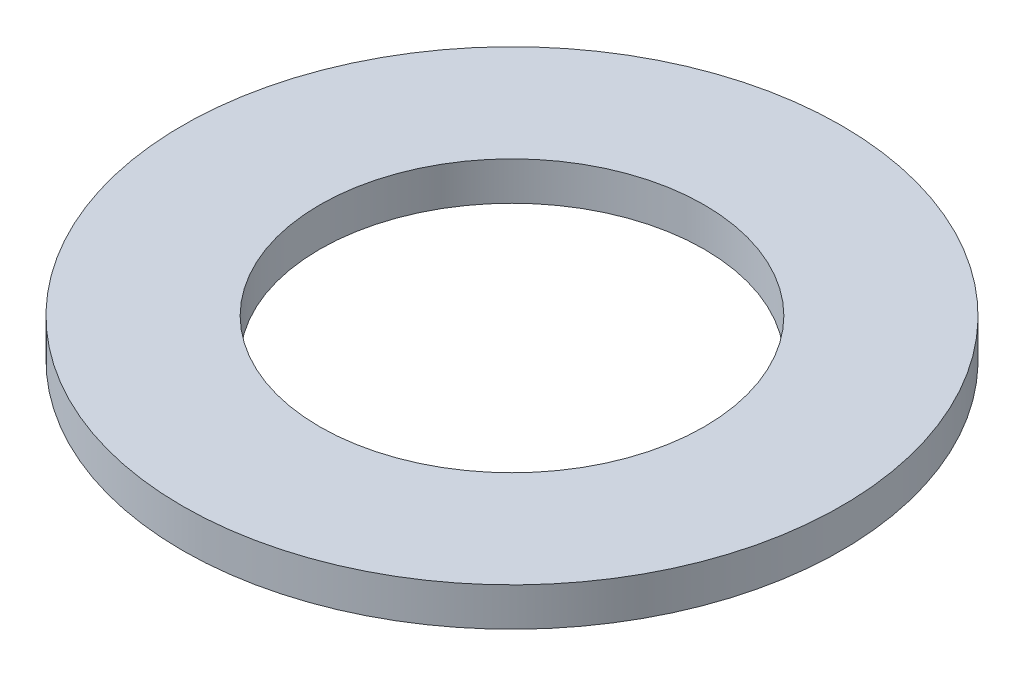
ISO-10303-21;
HEADER;
FILE_DESCRIPTION(('STEP AP214'),'2;1');
FILE_NAME('part.step','',(''),(''),'','','');
FILE_SCHEMA(('AUTOMOTIVE_DESIGN { 1 0 10303 214 1 1 1 1 }'));
ENDSEC;
DATA;
#1=APPLICATION_CONTEXT('core data for automotive mechanical design processes');
#2=APPLICATION_PROTOCOL_DEFINITION('international standard','automotive_design',2000,#1);
#3=PRODUCT_CONTEXT('',#1,'mechanical');
#4=PRODUCT('Part','Part','',(#3));
#5=PRODUCT_RELATED_PRODUCT_CATEGORY('part','',(#4));
#6=PRODUCT_DEFINITION_FORMATION('','',#4);
#7=PRODUCT_DEFINITION_CONTEXT('part definition',#1,'design');
#8=PRODUCT_DEFINITION('design','',#6,#7);
#9=PRODUCT_DEFINITION_SHAPE('','',#8);
#10=(LENGTH_UNIT() NAMED_UNIT(*) SI_UNIT(.MILLI.,.METRE.));
#11=(NAMED_UNIT(*) PLANE_ANGLE_UNIT() SI_UNIT($,.RADIAN.));
#12=(NAMED_UNIT(*) SI_UNIT($,.STERADIAN.) SOLID_ANGLE_UNIT());
#13=UNCERTAINTY_MEASURE_WITH_UNIT(LENGTH_MEASURE(1.E-05),#10,'distance_accuracy_value','');
#14=(GEOMETRIC_REPRESENTATION_CONTEXT(3) GLOBAL_UNCERTAINTY_ASSIGNED_CONTEXT((#13)) GLOBAL_UNIT_ASSIGNED_CONTEXT((#10,
#11,#12)) REPRESENTATION_CONTEXT('',''));
#15=CARTESIAN_POINT('',(0.,0.,0.));
#16=DIRECTION('',(0.,0.,1.));
#17=DIRECTION('',(1.,0.,0.));
#18=AXIS2_PLACEMENT_3D('',#15,#16,#17);
#19=CARTESIAN_POINT('',(0.,7.,0.));
#20=DIRECTION('',(0.,-1.,0.));
#21=DIRECTION('',(0.,0.,-1.));
#22=AXIS2_PLACEMENT_3D('',#19,#20,#21);
#23=CYLINDRICAL_SURFACE('',#22,60.);
#24=CARTESIAN_POINT('',(0.,7.,0.));
#25=DIRECTION('',(0.,1.,0.));
#26=DIRECTION('',(0.,0.,1.));
#27=AXIS2_PLACEMENT_3D('',#24,#25,#26);
#28=CIRCLE('',#27,60.);
#29=CARTESIAN_POINT('',(0.,7.,60.));
#30=VERTEX_POINT('',#29);
#31=EDGE_CURVE('E10',#30,#30,#28,.T.);
#32=ORIENTED_EDGE('',*,*,#31,.F.);
#33=EDGE_LOOP('',(#32));
#34=FACE_BOUND('',#33,.T.);
#35=CARTESIAN_POINT('',(0.,0.,0.));
#36=DIRECTION('',(0.,1.,0.));
#37=DIRECTION('',(0.,0.,1.));
#38=AXIS2_PLACEMENT_3D('',#35,#36,#37);
#39=CIRCLE('',#38,60.);
#40=CARTESIAN_POINT('',(0.,0.,60.));
#41=VERTEX_POINT('',#40);
#42=EDGE_CURVE('E37',#41,#41,#39,.T.);
#43=ORIENTED_EDGE('',*,*,#42,.T.);
#44=EDGE_LOOP('',(#43));
#45=FACE_BOUND('',#44,.T.);
#46=ADVANCED_FACE('F40',(#34,#45),#23,.T.);
#47=CARTESIAN_POINT('',(0.,7.,0.));
#48=DIRECTION('',(0.,1.,0.));
#49=DIRECTION('',(0.,0.,1.));
#50=AXIS2_PLACEMENT_3D('',#47,#48,#49);
#51=PLANE('',#50);
#52=CARTESIAN_POINT('',(0.,7.,0.));
#53=DIRECTION('',(0.,1.,0.));
#54=DIRECTION('',(0.,0.,1.));
#55=AXIS2_PLACEMENT_3D('',#52,#53,#54);
#56=CIRCLE('',#55,35.);
#57=CARTESIAN_POINT('',(0.,7.,35.));
#58=VERTEX_POINT('',#57);
#59=EDGE_CURVE('E50',#58,#58,#56,.T.);
#60=ORIENTED_EDGE('',*,*,#59,.F.);
#61=EDGE_LOOP('',(#60));
#62=FACE_BOUND('',#61,.T.);
#63=ORIENTED_EDGE('',*,*,#31,.T.);
#64=EDGE_LOOP('',(#63));
#65=FACE_BOUND('',#64,.T.);
#66=ADVANCED_FACE('F59',(#62,#65),#51,.T.);
#67=CARTESIAN_POINT('',(0.,0.,0.));
#68=DIRECTION('',(0.,1.,0.));
#69=DIRECTION('',(0.,0.,1.));
#70=AXIS2_PLACEMENT_3D('',#67,#68,#69);
#71=PLANE('',#70);
#72=CARTESIAN_POINT('',(0.,0.,0.));
#73=DIRECTION('',(0.,1.,0.));
#74=DIRECTION('',(0.,0.,1.));
#75=AXIS2_PLACEMENT_3D('',#72,#73,#74);
#76=CIRCLE('',#75,35.);
#77=CARTESIAN_POINT('',(0.,0.,35.));
#78=VERTEX_POINT('',#77);
#79=EDGE_CURVE('E47',#78,#78,#76,.T.);
#80=ORIENTED_EDGE('',*,*,#79,.T.);
#81=EDGE_LOOP('',(#80));
#82=FACE_BOUND('',#81,.T.);
#83=ORIENTED_EDGE('',*,*,#42,.F.);
#84=EDGE_LOOP('',(#83));
#85=FACE_BOUND('',#84,.T.);
#86=ADVANCED_FACE('F58',(#82,#85),#71,.F.);
#87=CARTESIAN_POINT('',(0.,7.,0.));
#88=DIRECTION('',(0.,-1.,0.));
#89=DIRECTION('',(0.,0.,-1.));
#90=AXIS2_PLACEMENT_3D('',#87,#88,#89);
#91=CYLINDRICAL_SURFACE('',#90,35.);
#92=ORIENTED_EDGE('',*,*,#59,.T.);
#93=EDGE_LOOP('',(#92));
#94=FACE_BOUND('',#93,.T.);
#95=ORIENTED_EDGE('',*,*,#79,.F.);
#96=EDGE_LOOP('',(#95));
#97=FACE_BOUND('',#96,.T.);
#98=ADVANCED_FACE('F54',(#94,#97),#91,.F.);
#99=CLOSED_SHELL('',(#46,#66,#86,#98));
#100=MANIFOLD_SOLID_BREP('B2',#99);
#101=ADVANCED_BREP_SHAPE_REPRESENTATION('',(#18,#100),#14);
#102=SHAPE_DEFINITION_REPRESENTATION(#9,#101);
ENDSEC;
END-ISO-10303-21;
